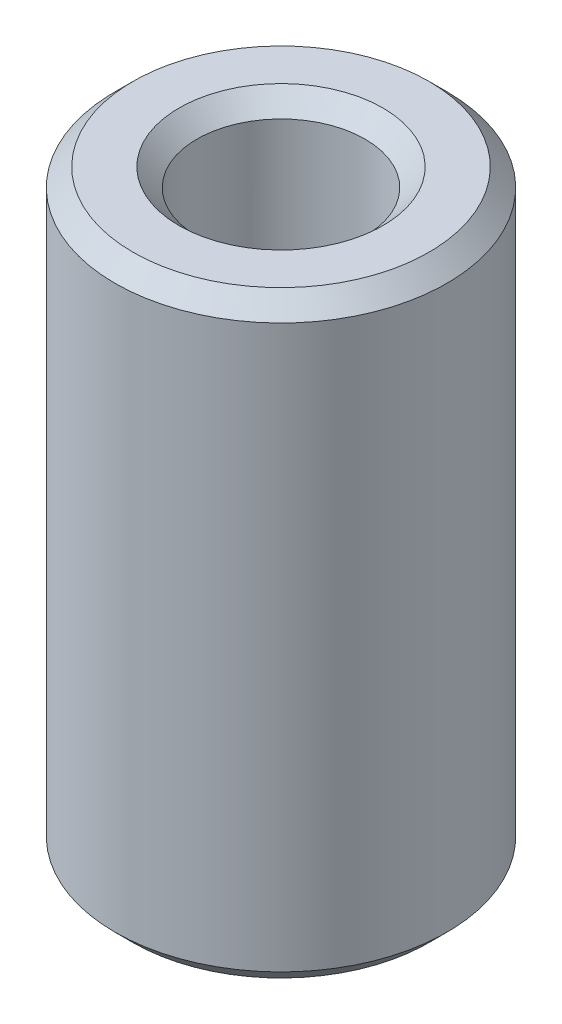
ISO-10303-21;
HEADER;
FILE_DESCRIPTION(('STEP AP214'),'2;1');
FILE_NAME('part.step','',(''),(''),'','','');
FILE_SCHEMA(('AUTOMOTIVE_DESIGN { 1 0 10303 214 1 1 1 1 }'));
ENDSEC;
DATA;
#1=APPLICATION_CONTEXT('core data for automotive mechanical design processes');
#2=APPLICATION_PROTOCOL_DEFINITION('international standard','automotive_design',2000,#1);
#3=PRODUCT_CONTEXT('',#1,'mechanical');
#4=PRODUCT('Part','Part','',(#3));
#5=PRODUCT_RELATED_PRODUCT_CATEGORY('part','',(#4));
#6=PRODUCT_DEFINITION_FORMATION('','',#4);
#7=PRODUCT_DEFINITION_CONTEXT('part definition',#1,'design');
#8=PRODUCT_DEFINITION('design','',#6,#7);
#9=PRODUCT_DEFINITION_SHAPE('','',#8);
#10=(LENGTH_UNIT() NAMED_UNIT(*) SI_UNIT(.MILLI.,.METRE.));
#11=(NAMED_UNIT(*) PLANE_ANGLE_UNIT() SI_UNIT($,.RADIAN.));
#12=(NAMED_UNIT(*) SI_UNIT($,.STERADIAN.) SOLID_ANGLE_UNIT());
#13=UNCERTAINTY_MEASURE_WITH_UNIT(LENGTH_MEASURE(1.E-05),#10,'distance_accuracy_value','');
#14=(GEOMETRIC_REPRESENTATION_CONTEXT(3) GLOBAL_UNCERTAINTY_ASSIGNED_CONTEXT((#13)) GLOBAL_UNIT_ASSIGNED_CONTEXT((#10,
#11,#12)) REPRESENTATION_CONTEXT('',''));
#15=CARTESIAN_POINT('',(0.,0.,0.));
#16=DIRECTION('',(0.,0.,1.));
#17=DIRECTION('',(1.,0.,0.));
#18=AXIS2_PLACEMENT_3D('',#15,#16,#17);
#19=CARTESIAN_POINT('',(0.,45.0360967932263,0.));
#20=DIRECTION('',(0.,-1.,0.));
#21=DIRECTION('',(0.,0.,-1.));
#22=AXIS2_PLACEMENT_3D('',#19,#20,#21);
#23=CYLINDRICAL_SURFACE('',#22,12.5);
#24=CARTESIAN_POINT('',(0.,1.35223061139228,0.));
#25=DIRECTION('',(0.,1.,0.));
#26=DIRECTION('',(0.,0.,1.));
#27=AXIS2_PLACEMENT_3D('',#24,#25,#26);
#28=CIRCLE('',#27,12.5);
#29=CARTESIAN_POINT('',(0.,1.35223061139227,-12.5));
#30=VERTEX_POINT('',#29);
#31=EDGE_CURVE('E10',#30,#30,#28,.T.);
#32=CARTESIAN_POINT('',(0.,43.683866181834,0.));
#33=DIRECTION('',(0.,1.,0.));
#34=DIRECTION('',(0.,0.,1.));
#35=AXIS2_PLACEMENT_3D('',#32,#33,#34);
#36=CIRCLE('',#35,12.5);
#37=CARTESIAN_POINT('',(0.,43.683866181834,-12.5));
#38=VERTEX_POINT('',#37);
#39=EDGE_CURVE('E50',#38,#38,#36,.F.);
#40=CARTESIAN_POINT('',(0.,1.35223061139227,-12.5));
#41=CARTESIAN_POINT('',(0.,1.79318514858437,-12.5));
#42=CARTESIAN_POINT('',(0.,2.23413968577648,-12.5));
#43=CARTESIAN_POINT('',(0.,3.11604876016068,-12.5));
#44=CARTESIAN_POINT('',(0.,3.55700329735278,-12.5));
#45=CARTESIAN_POINT('',(0.,4.43891237173698,-12.5));
#46=CARTESIAN_POINT('',(0.,4.87986690892909,-12.5));
#47=CARTESIAN_POINT('',(0.,5.76177598331329,-12.5));
#48=CARTESIAN_POINT('',(0.,6.20273052050539,-12.5));
#49=CARTESIAN_POINT('',(0.,7.0846395948896,-12.5));
#50=CARTESIAN_POINT('',(0.,7.5255941320817,-12.5));
#51=CARTESIAN_POINT('',(0.,8.4075032064659,-12.5));
#52=CARTESIAN_POINT('',(0.,8.848457743658,-12.5));
#53=CARTESIAN_POINT('',(0.,9.73036681804221,-12.5));
#54=CARTESIAN_POINT('',(0.,10.1713213552343,-12.5));
#55=CARTESIAN_POINT('',(0.,11.0532304296185,-12.5));
#56=CARTESIAN_POINT('',(0.,11.4941849668106,-12.5));
#57=CARTESIAN_POINT('',(0.,12.3760940411948,-12.5));
#58=CARTESIAN_POINT('',(0.,12.8170485783869,-12.5));
#59=CARTESIAN_POINT('',(0.,13.6989576527711,-12.5));
#60=CARTESIAN_POINT('',(0.,14.1399121899632,-12.5));
#61=CARTESIAN_POINT('',(0.,15.0218212643474,-12.5));
#62=CARTESIAN_POINT('',(0.,15.4627758015395,-12.5));
#63=CARTESIAN_POINT('',(0.,16.3446848759237,-12.5));
#64=CARTESIAN_POINT('',(0.,16.7856394131158,-12.5));
#65=CARTESIAN_POINT('',(0.,17.6675484875,-12.5));
#66=CARTESIAN_POINT('',(0.,18.1085030246921,-12.5));
#67=CARTESIAN_POINT('',(0.,18.9904120990763,-12.5));
#68=CARTESIAN_POINT('',(0.,19.4313666362684,-12.5));
#69=CARTESIAN_POINT('',(0.,20.3132757106526,-12.5));
#70=CARTESIAN_POINT('',(0.,20.7542302478447,-12.5));
#71=CARTESIAN_POINT('',(0.,21.6361393222289,-12.5));
#72=CARTESIAN_POINT('',(0.,22.0770938594211,-12.5));
#73=CARTESIAN_POINT('',(0.,22.9590029338053,-12.5));
#74=CARTESIAN_POINT('',(0.,23.3999574709974,-12.5));
#75=CARTESIAN_POINT('',(0.,24.2818665453816,-12.5));
#76=CARTESIAN_POINT('',(0.,24.7228210825737,-12.5));
#77=CARTESIAN_POINT('',(0.,25.6047301569579,-12.5));
#78=CARTESIAN_POINT('',(0.,26.04568469415,-12.5));
#79=CARTESIAN_POINT('',(0.,26.9275937685342,-12.5));
#80=CARTESIAN_POINT('',(0.,27.3685483057263,-12.5));
#81=CARTESIAN_POINT('',(0.,28.2504573801105,-12.5));
#82=CARTESIAN_POINT('',(0.,28.6914119173026,-12.5));
#83=CARTESIAN_POINT('',(0.,29.5733209916868,-12.5));
#84=CARTESIAN_POINT('',(0.,30.0142755288789,-12.5));
#85=CARTESIAN_POINT('',(0.,30.8961846032631,-12.5));
#86=CARTESIAN_POINT('',(0.,31.3371391404552,-12.5));
#87=CARTESIAN_POINT('',(0.,32.2190482148394,-12.5));
#88=CARTESIAN_POINT('',(0.,32.6600027520315,-12.5));
#89=CARTESIAN_POINT('',(0.,33.5419118264157,-12.5));
#90=CARTESIAN_POINT('',(0.,33.9828663636078,-12.5));
#91=CARTESIAN_POINT('',(0.,34.864775437992,-12.5));
#92=CARTESIAN_POINT('',(0.,35.3057299751841,-12.5));
#93=CARTESIAN_POINT('',(0.,36.1876390495683,-12.5));
#94=CARTESIAN_POINT('',(0.,36.6285935867604,-12.5));
#95=CARTESIAN_POINT('',(0.,37.5105026611446,-12.5));
#96=CARTESIAN_POINT('',(0.,37.9514571983367,-12.5));
#97=CARTESIAN_POINT('',(0.,38.8333662727209,-12.5));
#98=CARTESIAN_POINT('',(0.,39.274320809913,-12.5));
#99=CARTESIAN_POINT('',(0.,40.1562298842972,-12.5));
#100=CARTESIAN_POINT('',(0.,40.5971844214893,-12.5));
#101=CARTESIAN_POINT('',(0.,41.4790934958735,-12.5));
#102=CARTESIAN_POINT('',(0.,41.9200480330656,-12.5));
#103=CARTESIAN_POINT('',(0.,42.8019571074498,-12.5));
#104=CARTESIAN_POINT('',(0.,43.2429116446419,-12.5));
#105=CARTESIAN_POINT('',(0.,43.683866181834,-12.5));
#106=B_SPLINE_CURVE_WITH_KNOTS('',3,(#40,#41,#42,#43,#44,#45,#46,#47,#48,#49,#50,#51,#52,#53,
#54,#55,#56,#57,#58,#59,#60,#61,#62,#63,#64,#65,#66,#67,#68,#69,#70,#71,#72,#73,#74,#75,#76,#77,
#78,#79,#80,#81,#82,#83,#84,#85,#86,#87,#88,#89,#90,#91,#92,#93,#94,#95,#96,#97,#98,#99,#100,
#101,#102,#103,#104,#105),.UNSPECIFIED.,.F.,.F.,(4,2,2,2,2,2,2,2,2,2,2,2,2,2,2,2,2,2,2,2,2,2,2,
2,2,2,2,2,2,2,2,2,4),(0.,1.3228636115763,2.64572722315261,3.96859083472892,5.29145444630522,
6.61431805788153,7.93718166945783,9.26004528103413,10.5829088926104,11.9057725041867,
13.228636115763,14.5514997273394,15.8743633389157,17.197226950492,18.5200905620683,
19.8429541736446,21.1658177852209,22.4886813967972,23.8115450083735,25.1344086199498,
26.4572722315261,27.7801358431024,29.1029994546787,30.425863066255,31.7487266778313,
33.0715902894076,34.3944539009839,35.7173175125602,37.0401811241365,38.3630447357128,
39.6859083472891,41.0087719588655,42.3316355704418),.UNSPECIFIED.);
#107=EDGE_CURVE('BSEAM39',#30,#38,#106,.T.);
#108=ORIENTED_EDGE('',*,*,#31,.T.);
#109=ORIENTED_EDGE('',*,*,#39,.T.);
#110=ORIENTED_EDGE('',*,*,#107,.T.);
#111=ORIENTED_EDGE('',*,*,#107,.F.);
#112=EDGE_LOOP('',(#108,#110,#109,#111));
#113=FACE_BOUND('',#112,.T.);
#114=ADVANCED_FACE('F39',(#113),#23,.T.);
#115=CARTESIAN_POINT('',(0.,45.0360967932263,0.));
#116=DIRECTION('',(0.,1.,0.));
#117=DIRECTION('',(0.,0.,1.));
#118=AXIS2_PLACEMENT_3D('',#115,#116,#117);
#119=PLANE('',#118);
#120=CARTESIAN_POINT('',(0.,45.0360967932263,0.));
#121=DIRECTION('',(0.,1.,0.));
#122=DIRECTION('',(0.,0.,1.));
#123=AXIS2_PLACEMENT_3D('',#120,#121,#122);
#124=CIRCLE('',#123,7.67957772137565);
#125=CARTESIAN_POINT('',(0.,45.0360967932263,7.67957772137565));
#126=VERTEX_POINT('',#125);
#127=EDGE_CURVE('E58',#126,#126,#124,.F.);
#128=ORIENTED_EDGE('',*,*,#127,.T.);
#129=EDGE_LOOP('',(#128));
#130=FACE_BOUND('',#129,.T.);
#131=CARTESIAN_POINT('',(0.,45.0360967932263,0.));
#132=DIRECTION('',(0.,1.,0.));
#133=DIRECTION('',(0.,0.,1.));
#134=AXIS2_PLACEMENT_3D('',#131,#132,#133);
#135=CIRCLE('',#134,11.1477693886078);
#136=CARTESIAN_POINT('',(0.,45.0360967932263,11.1477693886078));
#137=VERTEX_POINT('',#136);
#138=EDGE_CURVE('E61',#137,#137,#135,.T.);
#139=ORIENTED_EDGE('',*,*,#138,.T.);
#140=EDGE_LOOP('',(#139));
#141=FACE_BOUND('',#140,.T.);
#142=ADVANCED_FACE('F88',(#130,#141),#119,.T.);
#143=CARTESIAN_POINT('',(0.,0.,0.));
#144=DIRECTION('',(0.,1.,0.));
#145=DIRECTION('',(0.,0.,1.));
#146=AXIS2_PLACEMENT_3D('',#143,#144,#145);
#147=PLANE('',#146);
#148=CARTESIAN_POINT('',(0.,0.,0.));
#149=DIRECTION('',(0.,1.,0.));
#150=DIRECTION('',(0.,0.,1.));
#151=AXIS2_PLACEMENT_3D('',#148,#149,#150);
#152=CIRCLE('',#151,7.67957772137561);
#153=CARTESIAN_POINT('',(0.,0.,7.67957772137561));
#154=VERTEX_POINT('',#153);
#155=EDGE_CURVE('E51',#154,#154,#152,.T.);
#156=ORIENTED_EDGE('',*,*,#155,.T.);
#157=EDGE_LOOP('',(#156));
#158=FACE_BOUND('',#157,.T.);
#159=CARTESIAN_POINT('',(0.,0.,0.));
#160=DIRECTION('',(0.,1.,0.));
#161=DIRECTION('',(0.,0.,1.));
#162=AXIS2_PLACEMENT_3D('',#159,#160,#161);
#163=CIRCLE('',#162,11.1477693886077);
#164=CARTESIAN_POINT('',(0.,0.,11.1477693886077));
#165=VERTEX_POINT('',#164);
#166=EDGE_CURVE('E54',#165,#165,#163,.F.);
#167=ORIENTED_EDGE('',*,*,#166,.T.);
#168=EDGE_LOOP('',(#167));
#169=FACE_BOUND('',#168,.T.);
#170=ADVANCED_FACE('F83',(#158,#169),#147,.F.);
#171=CARTESIAN_POINT('',(0.,45.0360967932263,0.));
#172=DIRECTION('',(0.,-1.,0.));
#173=DIRECTION('',(0.,0.,-1.));
#174=AXIS2_PLACEMENT_3D('',#171,#172,#173);
#175=CYLINDRICAL_SURFACE('',#174,6.32734710998338);
#176=CARTESIAN_POINT('',(0.,43.683866181834,0.));
#177=DIRECTION('',(0.,1.,0.));
#178=DIRECTION('',(0.,0.,1.));
#179=AXIS2_PLACEMENT_3D('',#176,#177,#178);
#180=CIRCLE('',#179,6.32734710998338);
#181=CARTESIAN_POINT('',(0.,43.683866181834,-6.32734710998338));
#182=VERTEX_POINT('',#181);
#183=EDGE_CURVE('E67',#182,#182,#180,.T.);
#184=CARTESIAN_POINT('',(0.,1.35223061139225,0.));
#185=DIRECTION('',(0.,1.,0.));
#186=DIRECTION('',(0.,0.,1.));
#187=AXIS2_PLACEMENT_3D('',#184,#185,#186);
#188=CIRCLE('',#187,6.32734710998338);
#189=CARTESIAN_POINT('',(0.,1.35223061139225,-6.32734710998338));
#190=VERTEX_POINT('',#189);
#191=EDGE_CURVE('E69',#190,#190,#188,.F.);
#192=CARTESIAN_POINT('',(0.,43.683866181834,-6.32734710998338));
#193=CARTESIAN_POINT('',(0.,43.2429116446419,-6.32734710998338));
#194=CARTESIAN_POINT('',(0.,42.8019571074498,-6.32734710998338));
#195=CARTESIAN_POINT('',(0.,41.9200480330656,-6.32734710998338));
#196=CARTESIAN_POINT('',(0.,41.4790934958735,-6.32734710998338));
#197=CARTESIAN_POINT('',(0.,40.5971844214893,-6.32734710998338));
#198=CARTESIAN_POINT('',(0.,40.1562298842972,-6.32734710998338));
#199=CARTESIAN_POINT('',(0.,39.274320809913,-6.32734710998338));
#200=CARTESIAN_POINT('',(0.,38.8333662727209,-6.32734710998338));
#201=CARTESIAN_POINT('',(0.,37.9514571983367,-6.32734710998338));
#202=CARTESIAN_POINT('',(0.,37.5105026611446,-6.32734710998338));
#203=CARTESIAN_POINT('',(0.,36.6285935867604,-6.32734710998338));
#204=CARTESIAN_POINT('',(0.,36.1876390495683,-6.32734710998338));
#205=CARTESIAN_POINT('',(0.,35.3057299751841,-6.32734710998338));
#206=CARTESIAN_POINT('',(0.,34.864775437992,-6.32734710998338));
#207=CARTESIAN_POINT('',(0.,33.9828663636078,-6.32734710998338));
#208=CARTESIAN_POINT('',(0.,33.5419118264157,-6.32734710998338));
#209=CARTESIAN_POINT('',(0.,32.6600027520315,-6.32734710998338));
#210=CARTESIAN_POINT('',(0.,32.2190482148394,-6.32734710998338));
#211=CARTESIAN_POINT('',(0.,31.3371391404552,-6.32734710998338));
#212=CARTESIAN_POINT('',(0.,30.8961846032631,-6.32734710998338));
#213=CARTESIAN_POINT('',(0.,30.0142755288789,-6.32734710998338));
#214=CARTESIAN_POINT('',(0.,29.5733209916868,-6.32734710998338));
#215=CARTESIAN_POINT('',(0.,28.6914119173026,-6.32734710998338));
#216=CARTESIAN_POINT('',(0.,28.2504573801105,-6.32734710998338));
#217=CARTESIAN_POINT('',(0.,27.3685483057263,-6.32734710998338));
#218=CARTESIAN_POINT('',(0.,26.9275937685341,-6.32734710998338));
#219=CARTESIAN_POINT('',(0.,26.0456846941499,-6.32734710998338));
#220=CARTESIAN_POINT('',(0.,25.6047301569578,-6.32734710998338));
#221=CARTESIAN_POINT('',(0.,24.7228210825736,-6.32734710998338));
#222=CARTESIAN_POINT('',(0.,24.2818665453815,-6.32734710998338));
#223=CARTESIAN_POINT('',(0.,23.3999574709973,-6.32734710998338));
#224=CARTESIAN_POINT('',(0.,22.9590029338052,-6.32734710998338));
#225=CARTESIAN_POINT('',(0.,22.077093859421,-6.32734710998338));
#226=CARTESIAN_POINT('',(0.,21.6361393222289,-6.32734710998338));
#227=CARTESIAN_POINT('',(0.,20.7542302478447,-6.32734710998338));
#228=CARTESIAN_POINT('',(0.,20.3132757106526,-6.32734710998338));
#229=CARTESIAN_POINT('',(0.,19.4313666362684,-6.32734710998338));
#230=CARTESIAN_POINT('',(0.,18.9904120990763,-6.32734710998338));
#231=CARTESIAN_POINT('',(0.,18.1085030246921,-6.32734710998338));
#232=CARTESIAN_POINT('',(0.,17.6675484875,-6.32734710998338));
#233=CARTESIAN_POINT('',(0.,16.7856394131158,-6.32734710998338));
#234=CARTESIAN_POINT('',(0.,16.3446848759237,-6.32734710998338));
#235=CARTESIAN_POINT('',(0.,15.4627758015395,-6.32734710998338));
#236=CARTESIAN_POINT('',(0.,15.0218212643474,-6.32734710998338));
#237=CARTESIAN_POINT('',(0.,14.1399121899632,-6.32734710998338));
#238=CARTESIAN_POINT('',(0.,13.6989576527711,-6.32734710998338));
#239=CARTESIAN_POINT('',(0.,12.8170485783869,-6.32734710998338));
#240=CARTESIAN_POINT('',(0.,12.3760940411948,-6.32734710998338));
#241=CARTESIAN_POINT('',(0.,11.4941849668106,-6.32734710998338));
#242=CARTESIAN_POINT('',(0.,11.0532304296185,-6.32734710998338));
#243=CARTESIAN_POINT('',(0.,10.1713213552343,-6.32734710998338));
#244=CARTESIAN_POINT('',(0.,9.73036681804218,-6.32734710998338));
#245=CARTESIAN_POINT('',(0.,8.84845774365798,-6.32734710998338));
#246=CARTESIAN_POINT('',(0.,8.40750320646588,-6.32734710998338));
#247=CARTESIAN_POINT('',(0.,7.52559413208167,-6.32734710998338));
#248=CARTESIAN_POINT('',(0.,7.08463959488957,-6.32734710998338));
#249=CARTESIAN_POINT('',(0.,6.20273052050537,-6.32734710998338));
#250=CARTESIAN_POINT('',(0.,5.76177598331327,-6.32734710998338));
#251=CARTESIAN_POINT('',(0.,4.87986690892906,-6.32734710998338));
#252=CARTESIAN_POINT('',(0.,4.43891237173696,-6.32734710998338));
#253=CARTESIAN_POINT('',(0.,3.55700329735275,-6.32734710998338));
#254=CARTESIAN_POINT('',(0.,3.11604876016066,-6.32734710998338));
#255=CARTESIAN_POINT('',(0.,2.23413968577645,-6.32734710998338));
#256=CARTESIAN_POINT('',(0.,1.79318514858435,-6.32734710998338));
#257=CARTESIAN_POINT('',(0.,1.35223061139225,-6.32734710998338));
#258=B_SPLINE_CURVE_WITH_KNOTS('',3,(#192,#193,#194,#195,#196,#197,#198,#199,#200,#201,#202,
#203,#204,#205,#206,#207,#208,#209,#210,#211,#212,#213,#214,#215,#216,#217,#218,#219,#220,#221,
#222,#223,#224,#225,#226,#227,#228,#229,#230,#231,#232,#233,#234,#235,#236,#237,#238,#239,#240,
#241,#242,#243,#244,#245,#246,#247,#248,#249,#250,#251,#252,#253,#254,#255,#256,#257),
.UNSPECIFIED.,.F.,.F.,(4,2,2,2,2,2,2,2,2,2,2,2,2,2,2,2,2,2,2,2,2,2,2,2,2,2,2,2,2,2,2,2,4),(0.,
1.32286361157631,2.64572722315261,3.96859083472892,5.29145444630522,6.61431805788153,
7.93718166945783,9.26004528103414,10.5829088926104,11.9057725041867,13.2286361157631,
14.5514997273394,15.8743633389157,17.197226950492,18.5200905620683,19.8429541736446,
21.1658177852209,22.4886813967972,23.8115450083735,25.1344086199498,26.4572722315261,
27.7801358431024,29.1029994546787,30.425863066255,31.7487266778313,33.0715902894076,
34.3944539009839,35.7173175125602,37.0401811241365,38.3630447357128,39.6859083472892,
41.0087719588655,42.3316355704418),.UNSPECIFIED.);
#259=EDGE_CURVE('BSEAM71',#182,#190,#258,.T.);
#260=ORIENTED_EDGE('',*,*,#183,.T.);
#261=ORIENTED_EDGE('',*,*,#191,.T.);
#262=ORIENTED_EDGE('',*,*,#259,.T.);
#263=ORIENTED_EDGE('',*,*,#259,.F.);
#264=EDGE_LOOP('',(#260,#262,#261,#263));
#265=FACE_BOUND('',#264,.T.);
#266=ADVANCED_FACE('F71',(#265),#175,.F.);
#267=CARTESIAN_POINT('',(0.,43.683866181834,0.));
#268=DIRECTION('',(0.,1.,0.));
#269=DIRECTION('',(0.,0.,1.));
#270=AXIS2_PLACEMENT_3D('',#267,#268,#269);
#271=CONICAL_SURFACE('',#270,6.32734710998338,0.785398163397453);
#272=ORIENTED_EDGE('',*,*,#127,.F.);
#273=EDGE_LOOP('',(#272));
#274=FACE_BOUND('',#273,.T.);
#275=ORIENTED_EDGE('',*,*,#183,.F.);
#276=EDGE_LOOP('',(#275));
#277=FACE_BOUND('',#276,.T.);
#278=ADVANCED_FACE('F77',(#274,#277),#271,.F.);
#279=CARTESIAN_POINT('',(0.,0.,0.));
#280=DIRECTION('',(0.,-1.,0.));
#281=DIRECTION('',(0.,0.,-1.));
#282=AXIS2_PLACEMENT_3D('',#279,#280,#281);
#283=CONICAL_SURFACE('',#282,7.67957772137561,0.785398163397443);
#284=ORIENTED_EDGE('',*,*,#191,.F.);
#285=EDGE_LOOP('',(#284));
#286=FACE_BOUND('',#285,.T.);
#287=ORIENTED_EDGE('',*,*,#155,.F.);
#288=EDGE_LOOP('',(#287));
#289=FACE_BOUND('',#288,.T.);
#290=ADVANCED_FACE('F73',(#286,#289),#283,.F.);
#291=CARTESIAN_POINT('',(0.,1.35223061139227,0.));
#292=DIRECTION('',(0.,1.,0.));
#293=DIRECTION('',(0.,0.,1.));
#294=AXIS2_PLACEMENT_3D('',#291,#292,#293);
#295=CONICAL_SURFACE('',#294,12.5,0.785398163397453);
#296=ORIENTED_EDGE('',*,*,#166,.F.);
#297=EDGE_LOOP('',(#296));
#298=FACE_BOUND('',#297,.T.);
#299=ORIENTED_EDGE('',*,*,#31,.F.);
#300=EDGE_LOOP('',(#299));
#301=FACE_BOUND('',#300,.T.);
#302=ADVANCED_FACE('F76',(#298,#301),#295,.T.);
#303=CARTESIAN_POINT('',(0.,45.0360967932263,0.));
#304=DIRECTION('',(0.,-1.,0.));
#305=DIRECTION('',(0.,0.,-1.));
#306=AXIS2_PLACEMENT_3D('',#303,#304,#305);
#307=CONICAL_SURFACE('',#306,11.1477693886078,0.785398163397445);
#308=ORIENTED_EDGE('',*,*,#39,.F.);
#309=EDGE_LOOP('',(#308));
#310=FACE_BOUND('',#309,.T.);
#311=ORIENTED_EDGE('',*,*,#138,.F.);
#312=EDGE_LOOP('',(#311));
#313=FACE_BOUND('',#312,.T.);
#314=ADVANCED_FACE('F45',(#310,#313),#307,.T.);
#315=CLOSED_SHELL('',(#114,#142,#170,#266,#278,#290,#302,#314));
#316=MANIFOLD_SOLID_BREP('B2',#315);
#317=ADVANCED_BREP_SHAPE_REPRESENTATION('',(#18,#316),#14);
#318=SHAPE_DEFINITION_REPRESENTATION(#9,#317);
ENDSEC;
END-ISO-10303-21;
